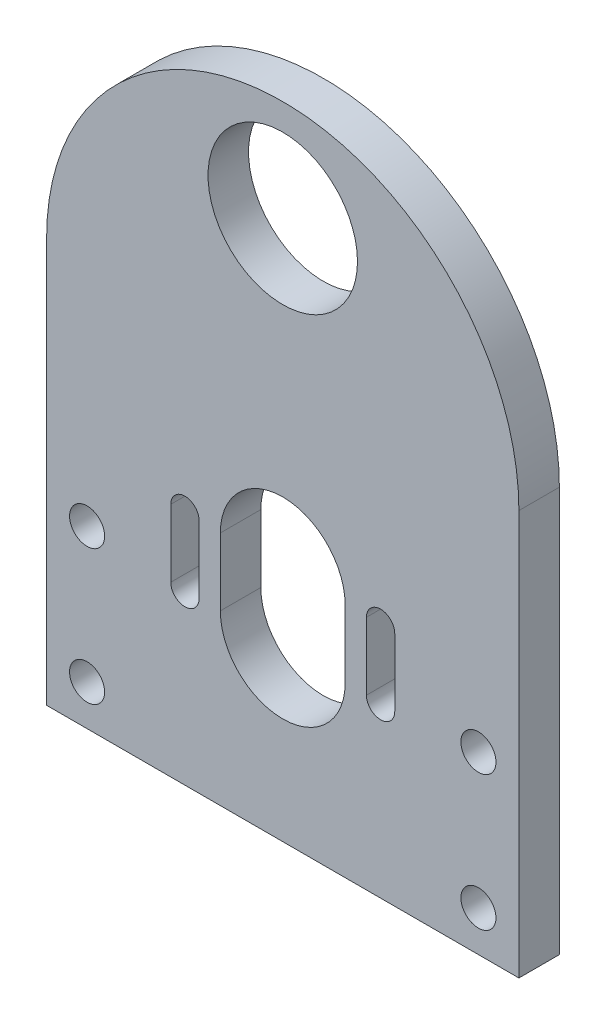
ISO-10303-21;
HEADER;
FILE_DESCRIPTION(('STEP AP214'),'2;1');
FILE_NAME('part.step','',(''),(''),'','','');
FILE_SCHEMA(('AUTOMOTIVE_DESIGN { 1 0 10303 214 1 1 1 1 }'));
ENDSEC;
DATA;
#1=APPLICATION_CONTEXT('core data for automotive mechanical design processes');
#2=APPLICATION_PROTOCOL_DEFINITION('international standard','automotive_design',2000,#1);
#3=PRODUCT_CONTEXT('',#1,'mechanical');
#4=PRODUCT('Part','Part','',(#3));
#5=PRODUCT_RELATED_PRODUCT_CATEGORY('part','',(#4));
#6=PRODUCT_DEFINITION_FORMATION('','',#4);
#7=PRODUCT_DEFINITION_CONTEXT('part definition',#1,'design');
#8=PRODUCT_DEFINITION('design','',#6,#7);
#9=PRODUCT_DEFINITION_SHAPE('','',#8);
#10=(LENGTH_UNIT() NAMED_UNIT(*) SI_UNIT(.MILLI.,.METRE.));
#11=(NAMED_UNIT(*) PLANE_ANGLE_UNIT() SI_UNIT($,.RADIAN.));
#12=(NAMED_UNIT(*) SI_UNIT($,.STERADIAN.) SOLID_ANGLE_UNIT());
#13=UNCERTAINTY_MEASURE_WITH_UNIT(LENGTH_MEASURE(1.E-05),#10,'distance_accuracy_value','');
#14=(GEOMETRIC_REPRESENTATION_CONTEXT(3) GLOBAL_UNCERTAINTY_ASSIGNED_CONTEXT((#13)) GLOBAL_UNIT_ASSIGNED_CONTEXT((#10,
#11,#12)) REPRESENTATION_CONTEXT('',''));
#15=CARTESIAN_POINT('',(0.,0.,0.));
#16=DIRECTION('',(0.,0.,1.));
#17=DIRECTION('',(1.,0.,0.));
#18=AXIS2_PLACEMENT_3D('',#15,#16,#17);
#19=CARTESIAN_POINT('',(-21.4103776781464,29.6521399019793,6.));
#20=DIRECTION('',(0.,0.,1.));
#21=DIRECTION('',(1.,0.,0.));
#22=AXIS2_PLACEMENT_3D('',#19,#20,#21);
#23=PLANE('',#22);
#24=CARTESIAN_POINT('',(7.58962232185361,-24.3478600980205,6.));
#25=DIRECTION('',(0.,0.,1.));
#26=DIRECTION('',(1.,0.,0.));
#27=AXIS2_PLACEMENT_3D('',#24,#25,#26);
#28=CIRCLE('',#27,2.6);
#29=CARTESIAN_POINT('',(10.1896223218536,-24.3478600980205,6.));
#30=VERTEX_POINT('',#29);
#31=EDGE_CURVE('E458',#30,#30,#28,.T.);
#32=ORIENTED_EDGE('',*,*,#31,.F.);
#33=EDGE_LOOP('',(#32));
#34=FACE_BOUND('',#33,.T.);
#35=CARTESIAN_POINT('',(7.58962232185354,-4.34786009802049,6.));
#36=DIRECTION('',(0.,0.,1.));
#37=DIRECTION('',(1.,0.,0.));
#38=AXIS2_PLACEMENT_3D('',#35,#36,#37);
#39=CIRCLE('',#38,2.6);
#40=CARTESIAN_POINT('',(10.1896223218535,-4.34786009802049,6.));
#41=VERTEX_POINT('',#40);
#42=EDGE_CURVE('E470',#41,#41,#39,.T.);
#43=ORIENTED_EDGE('',*,*,#42,.F.);
#44=EDGE_LOOP('',(#43));
#45=FACE_BOUND('',#44,.T.);
#46=DIRECTION('',(0.,-1.,0.));
#47=VECTOR('',#46,1.);
#48=CARTESIAN_POINT('',(-38.0103776781464,4.65213990197951,6.));
#49=LINE('',#48,#47);
#50=CARTESIAN_POINT('',(-38.0103776781464,4.65213990197951,6.));
#51=VERTEX_POINT('',#50);
#52=CARTESIAN_POINT('',(-38.0103776781464,-5.34786009802049,6.));
#53=VERTEX_POINT('',#52);
#54=EDGE_CURVE('E302',#51,#53,#49,.T.);
#55=ORIENTED_EDGE('',*,*,#54,.F.);
#56=CARTESIAN_POINT('',(-35.9103776781464,4.65213990197951,6.));
#57=DIRECTION('',(0.,0.,1.));
#58=DIRECTION('',(1.,0.,0.));
#59=AXIS2_PLACEMENT_3D('',#56,#57,#58);
#60=CIRCLE('',#59,2.1);
#61=CARTESIAN_POINT('',(-33.8103776781464,4.65213990197951,6.));
#62=VERTEX_POINT('',#61);
#63=EDGE_CURVE('E294',#62,#51,#60,.T.);
#64=ORIENTED_EDGE('',*,*,#63,.F.);
#65=DIRECTION('',(0.,-1.,0.));
#66=VECTOR('',#65,1.);
#67=CARTESIAN_POINT('',(-33.8103776781464,4.65213990197951,6.));
#68=LINE('',#67,#66);
#69=CARTESIAN_POINT('',(-33.8103776781464,-5.34786009802049,6.));
#70=VERTEX_POINT('',#69);
#71=EDGE_CURVE('E317',#62,#70,#68,.T.);
#72=ORIENTED_EDGE('',*,*,#71,.T.);
#73=CARTESIAN_POINT('',(-35.9103776781464,-5.34786009802049,6.));
#74=DIRECTION('',(0.,0.,1.));
#75=DIRECTION('',(1.,0.,0.));
#76=AXIS2_PLACEMENT_3D('',#73,#74,#75);
#77=CIRCLE('',#76,2.1);
#78=EDGE_CURVE('E315',#53,#70,#77,.T.);
#79=ORIENTED_EDGE('',*,*,#78,.F.);
#80=EDGE_LOOP('',(#55,#64,#72,#79));
#81=FACE_BOUND('',#80,.T.);
#82=DIRECTION('',(0.,-1.,0.));
#83=VECTOR('',#82,1.);
#84=CARTESIAN_POINT('',(-9.0103776781464,4.65213990197951,6.));
#85=LINE('',#84,#83);
#86=CARTESIAN_POINT('',(-9.0103776781464,4.65213990197951,6.));
#87=VERTEX_POINT('',#86);
#88=CARTESIAN_POINT('',(-9.0103776781464,-5.34786009802049,6.));
#89=VERTEX_POINT('',#88);
#90=EDGE_CURVE('E334',#87,#89,#85,.T.);
#91=ORIENTED_EDGE('',*,*,#90,.F.);
#92=CARTESIAN_POINT('',(-6.9103776781464,4.65213990197951,6.));
#93=DIRECTION('',(0.,0.,1.));
#94=DIRECTION('',(1.,0.,0.));
#95=AXIS2_PLACEMENT_3D('',#92,#93,#94);
#96=CIRCLE('',#95,2.1);
#97=CARTESIAN_POINT('',(-4.8103776781464,4.65213990197951,6.));
#98=VERTEX_POINT('',#97);
#99=EDGE_CURVE('E332',#98,#87,#96,.T.);
#100=ORIENTED_EDGE('',*,*,#99,.F.);
#101=DIRECTION('',(0.,-1.,0.));
#102=VECTOR('',#101,1.);
#103=CARTESIAN_POINT('',(-4.8103776781464,4.65213990197951,6.));
#104=LINE('',#103,#102);
#105=CARTESIAN_POINT('',(-4.8103776781464,-5.34786009802049,6.));
#106=VERTEX_POINT('',#105);
#107=EDGE_CURVE('E340',#98,#106,#104,.T.);
#108=ORIENTED_EDGE('',*,*,#107,.T.);
#109=CARTESIAN_POINT('',(-6.9103776781464,-5.34786009802049,6.));
#110=DIRECTION('',(0.,0.,1.));
#111=DIRECTION('',(1.,0.,0.));
#112=AXIS2_PLACEMENT_3D('',#109,#110,#111);
#113=CIRCLE('',#112,2.1);
#114=EDGE_CURVE('E337',#89,#106,#113,.T.);
#115=ORIENTED_EDGE('',*,*,#114,.F.);
#116=EDGE_LOOP('',(#91,#100,#108,#115));
#117=FACE_BOUND('',#116,.T.);
#118=DIRECTION('',(0.,-1.,0.));
#119=VECTOR('',#118,1.);
#120=CARTESIAN_POINT('',(-30.6603776781464,4.6521399019795,6.));
#121=LINE('',#120,#119);
#122=CARTESIAN_POINT('',(-30.6603776781464,4.6521399019795,6.));
#123=VERTEX_POINT('',#122);
#124=CARTESIAN_POINT('',(-30.6603776781464,-5.34786009802049,6.));
#125=VERTEX_POINT('',#124);
#126=EDGE_CURVE('E366',#123,#125,#121,.T.);
#127=ORIENTED_EDGE('',*,*,#126,.F.);
#128=CARTESIAN_POINT('',(-21.4103776781464,4.65213990197951,6.));
#129=DIRECTION('',(0.,0.,1.));
#130=DIRECTION('',(1.,0.,0.));
#131=AXIS2_PLACEMENT_3D('',#128,#129,#130);
#132=CIRCLE('',#131,9.24999999999999);
#133=CARTESIAN_POINT('',(-12.1603776781464,4.65213990197951,6.));
#134=VERTEX_POINT('',#133);
#135=EDGE_CURVE('E364',#134,#123,#132,.T.);
#136=ORIENTED_EDGE('',*,*,#135,.F.);
#137=DIRECTION('',(0.,-1.,0.));
#138=VECTOR('',#137,1.);
#139=CARTESIAN_POINT('',(-12.1603776781464,4.65213990197951,6.));
#140=LINE('',#139,#138);
#141=CARTESIAN_POINT('',(-12.1603776781464,-5.34786009802049,6.));
#142=VERTEX_POINT('',#141);
#143=EDGE_CURVE('E372',#134,#142,#140,.T.);
#144=ORIENTED_EDGE('',*,*,#143,.T.);
#145=CARTESIAN_POINT('',(-21.4103776781464,-5.34786009802049,6.));
#146=DIRECTION('',(0.,0.,1.));
#147=DIRECTION('',(1.,0.,0.));
#148=AXIS2_PLACEMENT_3D('',#145,#146,#147);
#149=CIRCLE('',#148,9.24999999999999);
#150=EDGE_CURVE('E369',#125,#142,#149,.T.);
#151=ORIENTED_EDGE('',*,*,#150,.F.);
#152=EDGE_LOOP('',(#127,#136,#144,#151));
#153=FACE_BOUND('',#152,.T.);
#154=DIRECTION('',(0.,-1.,0.));
#155=VECTOR('',#154,1.);
#156=CARTESIAN_POINT('',(13.5896223218536,29.6521399019793,6.));
#157=LINE('',#156,#155);
#158=CARTESIAN_POINT('',(13.5896223218536,29.6521399019793,6.));
#159=VERTEX_POINT('',#158);
#160=CARTESIAN_POINT('',(13.5896223218536,-30.3478600980205,6.));
#161=VERTEX_POINT('',#160);
#162=EDGE_CURVE('E396',#159,#161,#157,.T.);
#163=ORIENTED_EDGE('',*,*,#162,.F.);
#164=CARTESIAN_POINT('',(-21.4103776781464,29.6521399019793,6.));
#165=DIRECTION('',(0.,0.,1.));
#166=DIRECTION('',(1.,0.,0.));
#167=AXIS2_PLACEMENT_3D('',#164,#165,#166);
#168=CIRCLE('',#167,35.);
#169=CARTESIAN_POINT('',(-56.4103776781464,29.6521399019793,6.));
#170=VERTEX_POINT('',#169);
#171=EDGE_CURVE('E404',#159,#170,#168,.T.);
#172=ORIENTED_EDGE('',*,*,#171,.T.);
#173=DIRECTION('',(0.,-1.,0.));
#174=VECTOR('',#173,1.);
#175=CARTESIAN_POINT('',(-56.4103776781464,29.6521399019793,6.));
#176=LINE('',#175,#174);
#177=CARTESIAN_POINT('',(-56.4103776781464,-30.3478600980205,6.));
#178=VERTEX_POINT('',#177);
#179=EDGE_CURVE('E402',#170,#178,#176,.T.);
#180=ORIENTED_EDGE('',*,*,#179,.T.);
#181=DIRECTION('',(1.,0.,0.));
#182=VECTOR('',#181,1.);
#183=CARTESIAN_POINT('',(-56.4103776781464,-30.3478600980205,6.));
#184=LINE('',#183,#182);
#185=EDGE_CURVE('E399',#178,#161,#184,.T.);
#186=ORIENTED_EDGE('',*,*,#185,.T.);
#187=EDGE_LOOP('',(#163,#172,#180,#186));
#188=FACE_BOUND('',#187,.T.);
#189=CARTESIAN_POINT('',(-50.4103776781465,-4.34786009802049,6.));
#190=DIRECTION('',(0.,0.,1.));
#191=DIRECTION('',(1.,0.,0.));
#192=AXIS2_PLACEMENT_3D('',#189,#190,#191);
#193=CIRCLE('',#192,2.6);
#194=CARTESIAN_POINT('',(-47.8103776781465,-4.34786009802049,6.));
#195=VERTEX_POINT('',#194);
#196=EDGE_CURVE('E323',#195,#195,#193,.T.);
#197=ORIENTED_EDGE('',*,*,#196,.F.);
#198=EDGE_LOOP('',(#197));
#199=FACE_BOUND('',#198,.T.);
#200=CARTESIAN_POINT('',(-21.4103776781464,49.6521399019795,6.));
#201=DIRECTION('',(0.,0.,1.));
#202=DIRECTION('',(1.,0.,0.));
#203=AXIS2_PLACEMENT_3D('',#200,#201,#202);
#204=CIRCLE('',#203,11.075);
#205=CARTESIAN_POINT('',(-10.3353776781464,49.6521399019795,6.));
#206=VERTEX_POINT('',#205);
#207=EDGE_CURVE('E449',#206,#206,#204,.T.);
#208=ORIENTED_EDGE('',*,*,#207,.F.);
#209=EDGE_LOOP('',(#208));
#210=FACE_BOUND('',#209,.T.);
#211=CARTESIAN_POINT('',(-50.4103776781464,-24.3478600980205,6.));
#212=DIRECTION('',(0.,0.,1.));
#213=DIRECTION('',(1.,0.,0.));
#214=AXIS2_PLACEMENT_3D('',#211,#212,#213);
#215=CIRCLE('',#214,2.6);
#216=CARTESIAN_POINT('',(-47.8103776781464,-24.3478600980205,6.));
#217=VERTEX_POINT('',#216);
#218=EDGE_CURVE('E452',#217,#217,#215,.T.);
#219=ORIENTED_EDGE('',*,*,#218,.F.);
#220=EDGE_LOOP('',(#219));
#221=FACE_BOUND('',#220,.T.);
#222=ADVANCED_FACE('F180',(#34,#45,#81,#117,#153,#188,#199,#210,#221),#23,.T.);
#223=CARTESIAN_POINT('',(-21.4103776781464,29.6521399019793,0.));
#224=DIRECTION('',(0.,0.,1.));
#225=DIRECTION('',(1.,0.,0.));
#226=AXIS2_PLACEMENT_3D('',#223,#224,#225);
#227=PLANE('',#226);
#228=CARTESIAN_POINT('',(-6.9103776781464,4.65213990197951,0.));
#229=DIRECTION('',(0.,0.,1.));
#230=DIRECTION('',(1.,0.,0.));
#231=AXIS2_PLACEMENT_3D('',#228,#229,#230);
#232=CIRCLE('',#231,2.1);
#233=CARTESIAN_POINT('',(-4.8103776781464,4.6521399019795,0.));
#234=VERTEX_POINT('',#233);
#235=CARTESIAN_POINT('',(-9.0103776781464,4.65213990197951,0.));
#236=VERTEX_POINT('',#235);
#237=EDGE_CURVE('E310',#234,#236,#232,.T.);
#238=ORIENTED_EDGE('',*,*,#237,.T.);
#239=DIRECTION('',(0.,-1.,0.));
#240=VECTOR('',#239,1.);
#241=CARTESIAN_POINT('',(-9.0103776781464,4.65213990197951,0.));
#242=LINE('',#241,#240);
#243=CARTESIAN_POINT('',(-9.0103776781464,-5.34786009802049,0.));
#244=VERTEX_POINT('',#243);
#245=EDGE_CURVE('E346',#236,#244,#242,.T.);
#246=ORIENTED_EDGE('',*,*,#245,.T.);
#247=CARTESIAN_POINT('',(-6.9103776781464,-5.34786009802049,0.));
#248=DIRECTION('',(0.,0.,1.));
#249=DIRECTION('',(1.,0.,0.));
#250=AXIS2_PLACEMENT_3D('',#247,#248,#249);
#251=CIRCLE('',#250,2.1);
#252=CARTESIAN_POINT('',(-4.81037767814639,-5.34786009802049,0.));
#253=VERTEX_POINT('',#252);
#254=EDGE_CURVE('E349',#244,#253,#251,.T.);
#255=ORIENTED_EDGE('',*,*,#254,.T.);
#256=DIRECTION('',(0.,-1.,0.));
#257=VECTOR('',#256,1.);
#258=CARTESIAN_POINT('',(-4.8103776781464,4.65213990197951,0.));
#259=LINE('',#258,#257);
#260=EDGE_CURVE('E335',#234,#253,#259,.T.);
#261=ORIENTED_EDGE('',*,*,#260,.F.);
#262=EDGE_LOOP('',(#238,#246,#255,#261));
#263=FACE_BOUND('',#262,.T.);
#264=DIRECTION('',(0.,-1.,0.));
#265=VECTOR('',#264,1.);
#266=CARTESIAN_POINT('',(13.5896223218536,29.6521399019793,0.));
#267=LINE('',#266,#265);
#268=CARTESIAN_POINT('',(13.5896223218536,29.6521399019793,0.));
#269=VERTEX_POINT('',#268);
#270=CARTESIAN_POINT('',(13.5896223218536,-30.3478600980205,0.));
#271=VERTEX_POINT('',#270);
#272=EDGE_CURVE('E395',#269,#271,#267,.T.);
#273=ORIENTED_EDGE('',*,*,#272,.T.);
#274=DIRECTION('',(1.,0.,0.));
#275=VECTOR('',#274,1.);
#276=CARTESIAN_POINT('',(-56.4103776781464,-30.3478600980205,0.));
#277=LINE('',#276,#275);
#278=CARTESIAN_POINT('',(-56.4103776781464,-30.3478600980205,0.));
#279=VERTEX_POINT('',#278);
#280=EDGE_CURVE('E408',#279,#271,#277,.T.);
#281=ORIENTED_EDGE('',*,*,#280,.F.);
#282=DIRECTION('',(0.,-1.,0.));
#283=VECTOR('',#282,1.);
#284=CARTESIAN_POINT('',(-56.4103776781464,29.6521399019793,0.));
#285=LINE('',#284,#283);
#286=CARTESIAN_POINT('',(-56.4103776781464,29.6521399019793,0.));
#287=VERTEX_POINT('',#286);
#288=EDGE_CURVE('E411',#287,#279,#285,.T.);
#289=ORIENTED_EDGE('',*,*,#288,.F.);
#290=CARTESIAN_POINT('',(-21.4103776781464,29.6521399019793,0.));
#291=DIRECTION('',(0.,0.,1.));
#292=DIRECTION('',(1.,0.,0.));
#293=AXIS2_PLACEMENT_3D('',#290,#291,#292);
#294=CIRCLE('',#293,35.);
#295=EDGE_CURVE('E400',#269,#287,#294,.T.);
#296=ORIENTED_EDGE('',*,*,#295,.F.);
#297=EDGE_LOOP('',(#273,#281,#289,#296));
#298=FACE_BOUND('',#297,.T.);
#299=CARTESIAN_POINT('',(-21.4103776781464,4.65213990197951,0.));
#300=DIRECTION('',(0.,0.,1.));
#301=DIRECTION('',(1.,0.,0.));
#302=AXIS2_PLACEMENT_3D('',#299,#300,#301);
#303=CIRCLE('',#302,9.24999999999999);
#304=CARTESIAN_POINT('',(-12.1603776781464,4.65213990197951,0.));
#305=VERTEX_POINT('',#304);
#306=CARTESIAN_POINT('',(-30.6603776781464,4.6521399019795,0.));
#307=VERTEX_POINT('',#306);
#308=EDGE_CURVE('E363',#305,#307,#303,.T.);
#309=ORIENTED_EDGE('',*,*,#308,.T.);
#310=DIRECTION('',(0.,-1.,0.));
#311=VECTOR('',#310,1.);
#312=CARTESIAN_POINT('',(-30.6603776781464,4.6521399019795,0.));
#313=LINE('',#312,#311);
#314=CARTESIAN_POINT('',(-30.6603776781464,-5.34786009802049,0.));
#315=VERTEX_POINT('',#314);
#316=EDGE_CURVE('E378',#307,#315,#313,.T.);
#317=ORIENTED_EDGE('',*,*,#316,.T.);
#318=CARTESIAN_POINT('',(-21.4103776781464,-5.34786009802049,0.));
#319=DIRECTION('',(0.,0.,1.));
#320=DIRECTION('',(1.,0.,0.));
#321=AXIS2_PLACEMENT_3D('',#318,#319,#320);
#322=CIRCLE('',#321,9.24999999999999);
#323=CARTESIAN_POINT('',(-12.1603776781464,-5.34786009802049,0.));
#324=VERTEX_POINT('',#323);
#325=EDGE_CURVE('E381',#315,#324,#322,.T.);
#326=ORIENTED_EDGE('',*,*,#325,.T.);
#327=DIRECTION('',(0.,-1.,0.));
#328=VECTOR('',#327,1.);
#329=CARTESIAN_POINT('',(-12.1603776781464,4.65213990197951,0.));
#330=LINE('',#329,#328);
#331=EDGE_CURVE('E367',#305,#324,#330,.T.);
#332=ORIENTED_EDGE('',*,*,#331,.F.);
#333=EDGE_LOOP('',(#309,#317,#326,#332));
#334=FACE_BOUND('',#333,.T.);
#335=CARTESIAN_POINT('',(-35.9103776781464,4.65213990197951,0.));
#336=DIRECTION('',(0.,0.,1.));
#337=DIRECTION('',(1.,0.,0.));
#338=AXIS2_PLACEMENT_3D('',#335,#336,#337);
#339=CIRCLE('',#338,2.1);
#340=CARTESIAN_POINT('',(-33.8103776781464,4.6521399019795,0.));
#341=VERTEX_POINT('',#340);
#342=CARTESIAN_POINT('',(-38.0103776781464,4.65213990197951,0.));
#343=VERTEX_POINT('',#342);
#344=EDGE_CURVE('E205',#341,#343,#339,.T.);
#345=ORIENTED_EDGE('',*,*,#344,.T.);
#346=DIRECTION('',(0.,-1.,0.));
#347=VECTOR('',#346,1.);
#348=CARTESIAN_POINT('',(-38.0103776781464,4.65213990197951,0.));
#349=LINE('',#348,#347);
#350=CARTESIAN_POINT('',(-38.0103776781464,-5.34786009802049,0.));
#351=VERTEX_POINT('',#350);
#352=EDGE_CURVE('E309',#343,#351,#349,.T.);
#353=ORIENTED_EDGE('',*,*,#352,.T.);
#354=CARTESIAN_POINT('',(-35.9103776781464,-5.34786009802049,0.));
#355=DIRECTION('',(0.,0.,1.));
#356=DIRECTION('',(1.,0.,0.));
#357=AXIS2_PLACEMENT_3D('',#354,#355,#356);
#358=CIRCLE('',#357,2.1);
#359=CARTESIAN_POINT('',(-33.8103776781464,-5.34786009802049,0.));
#360=VERTEX_POINT('',#359);
#361=EDGE_CURVE('E325',#351,#360,#358,.T.);
#362=ORIENTED_EDGE('',*,*,#361,.T.);
#363=DIRECTION('',(0.,-1.,0.));
#364=VECTOR('',#363,1.);
#365=CARTESIAN_POINT('',(-33.8103776781464,4.65213990197951,0.));
#366=LINE('',#365,#364);
#367=EDGE_CURVE('E303',#341,#360,#366,.T.);
#368=ORIENTED_EDGE('',*,*,#367,.F.);
#369=EDGE_LOOP('',(#345,#353,#362,#368));
#370=FACE_BOUND('',#369,.T.);
#371=CARTESIAN_POINT('',(-50.4103776781465,-4.34786009802049,0.));
#372=DIRECTION('',(0.,0.,1.));
#373=DIRECTION('',(1.,0.,0.));
#374=AXIS2_PLACEMENT_3D('',#371,#372,#373);
#375=CIRCLE('',#374,2.6);
#376=CARTESIAN_POINT('',(-47.8103776781465,-4.34786009802049,0.));
#377=VERTEX_POINT('',#376);
#378=EDGE_CURVE('E473',#377,#377,#375,.T.);
#379=ORIENTED_EDGE('',*,*,#378,.T.);
#380=EDGE_LOOP('',(#379));
#381=FACE_BOUND('',#380,.T.);
#382=CARTESIAN_POINT('',(7.58962232185354,-4.34786009802049,0.));
#383=DIRECTION('',(0.,0.,1.));
#384=DIRECTION('',(1.,0.,0.));
#385=AXIS2_PLACEMENT_3D('',#382,#383,#384);
#386=CIRCLE('',#385,2.6);
#387=CARTESIAN_POINT('',(10.1896223218535,-4.34786009802049,0.));
#388=VERTEX_POINT('',#387);
#389=EDGE_CURVE('E467',#388,#388,#386,.T.);
#390=ORIENTED_EDGE('',*,*,#389,.T.);
#391=EDGE_LOOP('',(#390));
#392=FACE_BOUND('',#391,.T.);
#393=CARTESIAN_POINT('',(-21.4103776781464,49.6521399019795,0.));
#394=DIRECTION('',(0.,0.,1.));
#395=DIRECTION('',(1.,0.,0.));
#396=AXIS2_PLACEMENT_3D('',#393,#394,#395);
#397=CIRCLE('',#396,11.075);
#398=CARTESIAN_POINT('',(-10.3353776781464,49.6521399019795,0.));
#399=VERTEX_POINT('',#398);
#400=EDGE_CURVE('E464',#399,#399,#397,.T.);
#401=ORIENTED_EDGE('',*,*,#400,.T.);
#402=EDGE_LOOP('',(#401));
#403=FACE_BOUND('',#402,.T.);
#404=CARTESIAN_POINT('',(7.58962232185361,-24.3478600980205,0.));
#405=DIRECTION('',(0.,0.,1.));
#406=DIRECTION('',(1.,0.,0.));
#407=AXIS2_PLACEMENT_3D('',#404,#405,#406);
#408=CIRCLE('',#407,2.6);
#409=CARTESIAN_POINT('',(10.1896223218536,-24.3478600980205,0.));
#410=VERTEX_POINT('',#409);
#411=EDGE_CURVE('E454',#410,#410,#408,.T.);
#412=ORIENTED_EDGE('',*,*,#411,.T.);
#413=EDGE_LOOP('',(#412));
#414=FACE_BOUND('',#413,.T.);
#415=CARTESIAN_POINT('',(-50.4103776781464,-24.3478600980205,0.));
#416=DIRECTION('',(0.,0.,1.));
#417=DIRECTION('',(1.,0.,0.));
#418=AXIS2_PLACEMENT_3D('',#415,#416,#417);
#419=CIRCLE('',#418,2.6);
#420=CARTESIAN_POINT('',(-47.8103776781464,-24.3478600980205,0.));
#421=VERTEX_POINT('',#420);
#422=EDGE_CURVE('E455',#421,#421,#419,.T.);
#423=ORIENTED_EDGE('',*,*,#422,.T.);
#424=EDGE_LOOP('',(#423));
#425=FACE_BOUND('',#424,.T.);
#426=ADVANCED_FACE('F429',(#263,#298,#334,#370,#381,#392,#403,#414,#425),#227,.F.);
#427=CARTESIAN_POINT('',(13.5896223218536,29.6521399019793,6.));
#428=DIRECTION('',(1.,0.,0.));
#429=DIRECTION('',(0.,1.,0.));
#430=AXIS2_PLACEMENT_3D('',#427,#428,#429);
#431=PLANE('',#430);
#432=ORIENTED_EDGE('',*,*,#272,.F.);
#433=DIRECTION('',(0.,0.,-1.));
#434=VECTOR('',#433,1.);
#435=CARTESIAN_POINT('',(13.5896223218536,29.6521399019793,6.));
#436=LINE('',#435,#434);
#437=EDGE_CURVE('E12',#159,#269,#436,.T.);
#438=ORIENTED_EDGE('',*,*,#437,.F.);
#439=ORIENTED_EDGE('',*,*,#162,.T.);
#440=DIRECTION('',(0.,0.,-1.));
#441=VECTOR('',#440,1.);
#442=CARTESIAN_POINT('',(13.5896223218536,-30.3478600980205,6.));
#443=LINE('',#442,#441);
#444=EDGE_CURVE('E184',#161,#271,#443,.T.);
#445=ORIENTED_EDGE('',*,*,#444,.T.);
#446=EDGE_LOOP('',(#432,#438,#439,#445));
#447=FACE_BOUND('',#446,.T.);
#448=ADVANCED_FACE('F182',(#447),#431,.T.);
#449=CARTESIAN_POINT('',(-21.4103776781464,29.6521399019793,6.));
#450=DIRECTION('',(0.,0.,-1.));
#451=DIRECTION('',(-1.,0.,0.));
#452=AXIS2_PLACEMENT_3D('',#449,#450,#451);
#453=CYLINDRICAL_SURFACE('',#452,35.);
#454=ORIENTED_EDGE('',*,*,#295,.T.);
#455=DIRECTION('',(0.,0.,-1.));
#456=VECTOR('',#455,1.);
#457=CARTESIAN_POINT('',(-56.4103776781464,29.6521399019793,6.));
#458=LINE('',#457,#456);
#459=EDGE_CURVE('E189',#170,#287,#458,.T.);
#460=ORIENTED_EDGE('',*,*,#459,.F.);
#461=ORIENTED_EDGE('',*,*,#171,.F.);
#462=ORIENTED_EDGE('',*,*,#437,.T.);
#463=EDGE_LOOP('',(#454,#460,#461,#462));
#464=FACE_BOUND('',#463,.T.);
#465=ADVANCED_FACE('F433',(#464),#453,.T.);
#466=CARTESIAN_POINT('',(-56.4103776781464,29.6521399019793,6.));
#467=DIRECTION('',(1.,0.,0.));
#468=DIRECTION('',(0.,0.,-1.));
#469=AXIS2_PLACEMENT_3D('',#466,#467,#468);
#470=PLANE('',#469);
#471=ORIENTED_EDGE('',*,*,#288,.T.);
#472=DIRECTION('',(0.,0.,-1.));
#473=VECTOR('',#472,1.);
#474=CARTESIAN_POINT('',(-56.4103776781464,-30.3478600980205,6.));
#475=LINE('',#474,#473);
#476=EDGE_CURVE('E415',#178,#279,#475,.T.);
#477=ORIENTED_EDGE('',*,*,#476,.F.);
#478=ORIENTED_EDGE('',*,*,#179,.F.);
#479=ORIENTED_EDGE('',*,*,#459,.T.);
#480=EDGE_LOOP('',(#471,#477,#478,#479));
#481=FACE_BOUND('',#480,.T.);
#482=ADVANCED_FACE('F437',(#481),#470,.F.);
#483=CARTESIAN_POINT('',(-56.4103776781464,-30.3478600980205,6.));
#484=DIRECTION('',(0.,1.,0.));
#485=DIRECTION('',(-1.,0.,0.));
#486=AXIS2_PLACEMENT_3D('',#483,#484,#485);
#487=PLANE('',#486);
#488=ORIENTED_EDGE('',*,*,#280,.T.);
#489=ORIENTED_EDGE('',*,*,#444,.F.);
#490=ORIENTED_EDGE('',*,*,#185,.F.);
#491=ORIENTED_EDGE('',*,*,#476,.T.);
#492=EDGE_LOOP('',(#488,#489,#490,#491));
#493=FACE_BOUND('',#492,.T.);
#494=ADVANCED_FACE('F425',(#493),#487,.F.);
#495=CARTESIAN_POINT('',(-21.4103776781464,4.65213990197951,6.));
#496=DIRECTION('',(0.,0.,-1.));
#497=DIRECTION('',(-1.,0.,0.));
#498=AXIS2_PLACEMENT_3D('',#495,#496,#497);
#499=CYLINDRICAL_SURFACE('',#498,9.24999999999999);
#500=ORIENTED_EDGE('',*,*,#308,.F.);
#501=DIRECTION('',(0.,0.,-1.));
#502=VECTOR('',#501,1.);
#503=CARTESIAN_POINT('',(-12.1603776781464,4.65213990197951,6.));
#504=LINE('',#503,#502);
#505=EDGE_CURVE('E375',#134,#305,#504,.T.);
#506=ORIENTED_EDGE('',*,*,#505,.F.);
#507=ORIENTED_EDGE('',*,*,#135,.T.);
#508=DIRECTION('',(0.,0.,-1.));
#509=VECTOR('',#508,1.);
#510=CARTESIAN_POINT('',(-30.6603776781464,4.6521399019795,6.));
#511=LINE('',#510,#509);
#512=EDGE_CURVE('E392',#123,#307,#511,.T.);
#513=ORIENTED_EDGE('',*,*,#512,.T.);
#514=EDGE_LOOP('',(#500,#506,#507,#513));
#515=FACE_BOUND('',#514,.T.);
#516=ADVANCED_FACE('F532',(#515),#499,.F.);
#517=CARTESIAN_POINT('',(-30.6603776781464,4.6521399019795,6.));
#518=DIRECTION('',(1.,0.,0.));
#519=DIRECTION('',(0.,1.,0.));
#520=AXIS2_PLACEMENT_3D('',#517,#518,#519);
#521=PLANE('',#520);
#522=ORIENTED_EDGE('',*,*,#316,.F.);
#523=ORIENTED_EDGE('',*,*,#512,.F.);
#524=ORIENTED_EDGE('',*,*,#126,.T.);
#525=DIRECTION('',(0.,0.,-1.));
#526=VECTOR('',#525,1.);
#527=CARTESIAN_POINT('',(-30.6603776781464,-5.34786009802049,6.));
#528=LINE('',#527,#526);
#529=EDGE_CURVE('E390',#125,#315,#528,.T.);
#530=ORIENTED_EDGE('',*,*,#529,.T.);
#531=EDGE_LOOP('',(#522,#523,#524,#530));
#532=FACE_BOUND('',#531,.T.);
#533=ADVANCED_FACE('F528',(#532),#521,.T.);
#534=CARTESIAN_POINT('',(-21.4103776781464,-5.34786009802049,6.));
#535=DIRECTION('',(0.,0.,-1.));
#536=DIRECTION('',(-1.,0.,0.));
#537=AXIS2_PLACEMENT_3D('',#534,#535,#536);
#538=CYLINDRICAL_SURFACE('',#537,9.24999999999999);
#539=ORIENTED_EDGE('',*,*,#325,.F.);
#540=ORIENTED_EDGE('',*,*,#529,.F.);
#541=ORIENTED_EDGE('',*,*,#150,.T.);
#542=DIRECTION('',(0.,0.,-1.));
#543=VECTOR('',#542,1.);
#544=CARTESIAN_POINT('',(-12.1603776781464,-5.34786009802049,6.));
#545=LINE('',#544,#543);
#546=EDGE_CURVE('E388',#142,#324,#545,.T.);
#547=ORIENTED_EDGE('',*,*,#546,.T.);
#548=EDGE_LOOP('',(#539,#540,#541,#547));
#549=FACE_BOUND('',#548,.T.);
#550=ADVANCED_FACE('F524',(#549),#538,.F.);
#551=CARTESIAN_POINT('',(-12.1603776781464,4.65213990197951,6.));
#552=DIRECTION('',(1.,0.,0.));
#553=DIRECTION('',(0.,1.,0.));
#554=AXIS2_PLACEMENT_3D('',#551,#552,#553);
#555=PLANE('',#554);
#556=ORIENTED_EDGE('',*,*,#331,.T.);
#557=ORIENTED_EDGE('',*,*,#546,.F.);
#558=ORIENTED_EDGE('',*,*,#143,.F.);
#559=ORIENTED_EDGE('',*,*,#505,.T.);
#560=EDGE_LOOP('',(#556,#557,#558,#559));
#561=FACE_BOUND('',#560,.T.);
#562=ADVANCED_FACE('F520',(#561),#555,.F.);
#563=CARTESIAN_POINT('',(-6.9103776781464,4.65213990197951,6.));
#564=DIRECTION('',(0.,0.,-1.));
#565=DIRECTION('',(-1.,0.,0.));
#566=AXIS2_PLACEMENT_3D('',#563,#564,#565);
#567=CYLINDRICAL_SURFACE('',#566,2.1);
#568=ORIENTED_EDGE('',*,*,#237,.F.);
#569=DIRECTION('',(0.,0.,-1.));
#570=VECTOR('',#569,1.);
#571=CARTESIAN_POINT('',(-4.8103776781464,4.65213990197951,6.));
#572=LINE('',#571,#570);
#573=EDGE_CURVE('E343',#98,#234,#572,.T.);
#574=ORIENTED_EDGE('',*,*,#573,.F.);
#575=ORIENTED_EDGE('',*,*,#99,.T.);
#576=DIRECTION('',(0.,0.,-1.));
#577=VECTOR('',#576,1.);
#578=CARTESIAN_POINT('',(-9.0103776781464,4.65213990197951,6.));
#579=LINE('',#578,#577);
#580=EDGE_CURVE('E360',#87,#236,#579,.T.);
#581=ORIENTED_EDGE('',*,*,#580,.T.);
#582=EDGE_LOOP('',(#568,#574,#575,#581));
#583=FACE_BOUND('',#582,.T.);
#584=ADVANCED_FACE('F516',(#583),#567,.F.);
#585=CARTESIAN_POINT('',(-9.0103776781464,4.65213990197951,6.));
#586=DIRECTION('',(1.,0.,0.));
#587=DIRECTION('',(0.,0.,-1.));
#588=AXIS2_PLACEMENT_3D('',#585,#586,#587);
#589=PLANE('',#588);
#590=ORIENTED_EDGE('',*,*,#245,.F.);
#591=ORIENTED_EDGE('',*,*,#580,.F.);
#592=ORIENTED_EDGE('',*,*,#90,.T.);
#593=DIRECTION('',(0.,0.,-1.));
#594=VECTOR('',#593,1.);
#595=CARTESIAN_POINT('',(-9.0103776781464,-5.34786009802049,6.));
#596=LINE('',#595,#594);
#597=EDGE_CURVE('E358',#89,#244,#596,.T.);
#598=ORIENTED_EDGE('',*,*,#597,.T.);
#599=EDGE_LOOP('',(#590,#591,#592,#598));
#600=FACE_BOUND('',#599,.T.);
#601=ADVANCED_FACE('F512',(#600),#589,.T.);
#602=CARTESIAN_POINT('',(-6.9103776781464,-5.34786009802049,6.));
#603=DIRECTION('',(0.,0.,-1.));
#604=DIRECTION('',(-1.,0.,0.));
#605=AXIS2_PLACEMENT_3D('',#602,#603,#604);
#606=CYLINDRICAL_SURFACE('',#605,2.1);
#607=ORIENTED_EDGE('',*,*,#254,.F.);
#608=ORIENTED_EDGE('',*,*,#597,.F.);
#609=ORIENTED_EDGE('',*,*,#114,.T.);
#610=DIRECTION('',(0.,0.,-1.));
#611=VECTOR('',#610,1.);
#612=CARTESIAN_POINT('',(-4.81037767814639,-5.34786009802049,6.));
#613=LINE('',#612,#611);
#614=EDGE_CURVE('E356',#106,#253,#613,.T.);
#615=ORIENTED_EDGE('',*,*,#614,.T.);
#616=EDGE_LOOP('',(#607,#608,#609,#615));
#617=FACE_BOUND('',#616,.T.);
#618=ADVANCED_FACE('F508',(#617),#606,.F.);
#619=CARTESIAN_POINT('',(-4.8103776781464,4.65213990197951,6.));
#620=DIRECTION('',(1.,0.,0.));
#621=DIRECTION('',(0.,1.,0.));
#622=AXIS2_PLACEMENT_3D('',#619,#620,#621);
#623=PLANE('',#622);
#624=ORIENTED_EDGE('',*,*,#260,.T.);
#625=ORIENTED_EDGE('',*,*,#614,.F.);
#626=ORIENTED_EDGE('',*,*,#107,.F.);
#627=ORIENTED_EDGE('',*,*,#573,.T.);
#628=EDGE_LOOP('',(#624,#625,#626,#627));
#629=FACE_BOUND('',#628,.T.);
#630=ADVANCED_FACE('F505',(#629),#623,.F.);
#631=CARTESIAN_POINT('',(-35.9103776781464,4.65213990197951,6.));
#632=DIRECTION('',(0.,0.,-1.));
#633=DIRECTION('',(-1.,0.,0.));
#634=AXIS2_PLACEMENT_3D('',#631,#632,#633);
#635=CYLINDRICAL_SURFACE('',#634,2.1);
#636=ORIENTED_EDGE('',*,*,#344,.F.);
#637=DIRECTION('',(0.,0.,-1.));
#638=VECTOR('',#637,1.);
#639=CARTESIAN_POINT('',(-33.8103776781464,4.65213990197951,6.));
#640=LINE('',#639,#638);
#641=EDGE_CURVE('E298',#62,#341,#640,.T.);
#642=ORIENTED_EDGE('',*,*,#641,.F.);
#643=ORIENTED_EDGE('',*,*,#63,.T.);
#644=DIRECTION('',(0.,0.,-1.));
#645=VECTOR('',#644,1.);
#646=CARTESIAN_POINT('',(-38.0103776781464,4.65213990197951,6.));
#647=LINE('',#646,#645);
#648=EDGE_CURVE('E297',#51,#343,#647,.T.);
#649=ORIENTED_EDGE('',*,*,#648,.T.);
#650=EDGE_LOOP('',(#636,#642,#643,#649));
#651=FACE_BOUND('',#650,.T.);
#652=ADVANCED_FACE('F296',(#651),#635,.F.);
#653=CARTESIAN_POINT('',(-38.0103776781464,4.65213990197951,6.));
#654=DIRECTION('',(1.,0.,0.));
#655=DIRECTION('',(0.,0.,-1.));
#656=AXIS2_PLACEMENT_3D('',#653,#654,#655);
#657=PLANE('',#656);
#658=ORIENTED_EDGE('',*,*,#352,.F.);
#659=ORIENTED_EDGE('',*,*,#648,.F.);
#660=ORIENTED_EDGE('',*,*,#54,.T.);
#661=DIRECTION('',(0.,0.,-1.));
#662=VECTOR('',#661,1.);
#663=CARTESIAN_POINT('',(-38.0103776781464,-5.34786009802049,6.));
#664=LINE('',#663,#662);
#665=EDGE_CURVE('E311',#53,#351,#664,.T.);
#666=ORIENTED_EDGE('',*,*,#665,.T.);
#667=EDGE_LOOP('',(#658,#659,#660,#666));
#668=FACE_BOUND('',#667,.T.);
#669=ADVANCED_FACE('F306',(#668),#657,.T.);
#670=CARTESIAN_POINT('',(-35.9103776781464,-5.34786009802049,6.));
#671=DIRECTION('',(0.,0.,-1.));
#672=DIRECTION('',(-1.,0.,0.));
#673=AXIS2_PLACEMENT_3D('',#670,#671,#672);
#674=CYLINDRICAL_SURFACE('',#673,2.1);
#675=ORIENTED_EDGE('',*,*,#361,.F.);
#676=ORIENTED_EDGE('',*,*,#665,.F.);
#677=ORIENTED_EDGE('',*,*,#78,.T.);
#678=DIRECTION('',(0.,0.,-1.));
#679=VECTOR('',#678,1.);
#680=CARTESIAN_POINT('',(-33.8103776781464,-5.34786009802049,6.));
#681=LINE('',#680,#679);
#682=EDGE_CURVE('E197',#70,#360,#681,.T.);
#683=ORIENTED_EDGE('',*,*,#682,.T.);
#684=EDGE_LOOP('',(#675,#676,#677,#683));
#685=FACE_BOUND('',#684,.T.);
#686=ADVANCED_FACE('F494',(#685),#674,.F.);
#687=CARTESIAN_POINT('',(-33.8103776781464,4.65213990197951,6.));
#688=DIRECTION('',(1.,0.,0.));
#689=DIRECTION('',(0.,0.,-1.));
#690=AXIS2_PLACEMENT_3D('',#687,#688,#689);
#691=PLANE('',#690);
#692=ORIENTED_EDGE('',*,*,#367,.T.);
#693=ORIENTED_EDGE('',*,*,#682,.F.);
#694=ORIENTED_EDGE('',*,*,#71,.F.);
#695=ORIENTED_EDGE('',*,*,#641,.T.);
#696=EDGE_LOOP('',(#692,#693,#694,#695));
#697=FACE_BOUND('',#696,.T.);
#698=ADVANCED_FACE('F484',(#697),#691,.F.);
#699=CARTESIAN_POINT('',(-50.4103776781465,-4.34786009802049,6.));
#700=DIRECTION('',(0.,0.,-1.));
#701=DIRECTION('',(-1.,0.,0.));
#702=AXIS2_PLACEMENT_3D('',#699,#700,#701);
#703=CYLINDRICAL_SURFACE('',#702,2.6);
#704=ORIENTED_EDGE('',*,*,#196,.T.);
#705=EDGE_LOOP('',(#704));
#706=FACE_BOUND('',#705,.T.);
#707=ORIENTED_EDGE('',*,*,#378,.F.);
#708=EDGE_LOOP('',(#707));
#709=FACE_BOUND('',#708,.T.);
#710=ADVANCED_FACE('F481',(#706,#709),#703,.F.);
#711=CARTESIAN_POINT('',(7.58962232185354,-4.34786009802049,6.));
#712=DIRECTION('',(0.,0.,-1.));
#713=DIRECTION('',(-1.,0.,0.));
#714=AXIS2_PLACEMENT_3D('',#711,#712,#713);
#715=CYLINDRICAL_SURFACE('',#714,2.6);
#716=ORIENTED_EDGE('',*,*,#42,.T.);
#717=EDGE_LOOP('',(#716));
#718=FACE_BOUND('',#717,.T.);
#719=ORIENTED_EDGE('',*,*,#389,.F.);
#720=EDGE_LOOP('',(#719));
#721=FACE_BOUND('',#720,.T.);
#722=ADVANCED_FACE('F483',(#718,#721),#715,.F.);
#723=CARTESIAN_POINT('',(-21.4103776781464,49.6521399019795,6.));
#724=DIRECTION('',(0.,0.,-1.));
#725=DIRECTION('',(-1.,0.,0.));
#726=AXIS2_PLACEMENT_3D('',#723,#724,#725);
#727=CYLINDRICAL_SURFACE('',#726,11.075);
#728=ORIENTED_EDGE('',*,*,#207,.T.);
#729=EDGE_LOOP('',(#728));
#730=FACE_BOUND('',#729,.T.);
#731=ORIENTED_EDGE('',*,*,#400,.F.);
#732=EDGE_LOOP('',(#731));
#733=FACE_BOUND('',#732,.T.);
#734=ADVANCED_FACE('F491',(#730,#733),#727,.F.);
#735=CARTESIAN_POINT('',(7.58962232185361,-24.3478600980205,6.));
#736=DIRECTION('',(0.,0.,-1.));
#737=DIRECTION('',(-1.,0.,0.));
#738=AXIS2_PLACEMENT_3D('',#735,#736,#737);
#739=CYLINDRICAL_SURFACE('',#738,2.6);
#740=ORIENTED_EDGE('',*,*,#31,.T.);
#741=EDGE_LOOP('',(#740));
#742=FACE_BOUND('',#741,.T.);
#743=ORIENTED_EDGE('',*,*,#411,.F.);
#744=EDGE_LOOP('',(#743));
#745=FACE_BOUND('',#744,.T.);
#746=ADVANCED_FACE('F615',(#742,#745),#739,.F.);
#747=CARTESIAN_POINT('',(-50.4103776781464,-24.3478600980205,6.));
#748=DIRECTION('',(0.,0.,-1.));
#749=DIRECTION('',(-1.,0.,0.));
#750=AXIS2_PLACEMENT_3D('',#747,#748,#749);
#751=CYLINDRICAL_SURFACE('',#750,2.6);
#752=ORIENTED_EDGE('',*,*,#218,.T.);
#753=EDGE_LOOP('',(#752));
#754=FACE_BOUND('',#753,.T.);
#755=ORIENTED_EDGE('',*,*,#422,.F.);
#756=EDGE_LOOP('',(#755));
#757=FACE_BOUND('',#756,.T.);
#758=ADVANCED_FACE('F624',(#754,#757),#751,.F.);
#759=CLOSED_SHELL('',(#222,#426,#448,#465,#482,#494,#516,#533,#550,#562,#584,#601,#618,#630,
#652,#669,#686,#698,#710,#722,#734,#746,#758));
#760=MANIFOLD_SOLID_BREP('B2',#759);
#761=ADVANCED_BREP_SHAPE_REPRESENTATION('',(#18,#760),#14);
#762=SHAPE_DEFINITION_REPRESENTATION(#9,#761);
ENDSEC;
END-ISO-10303-21;
